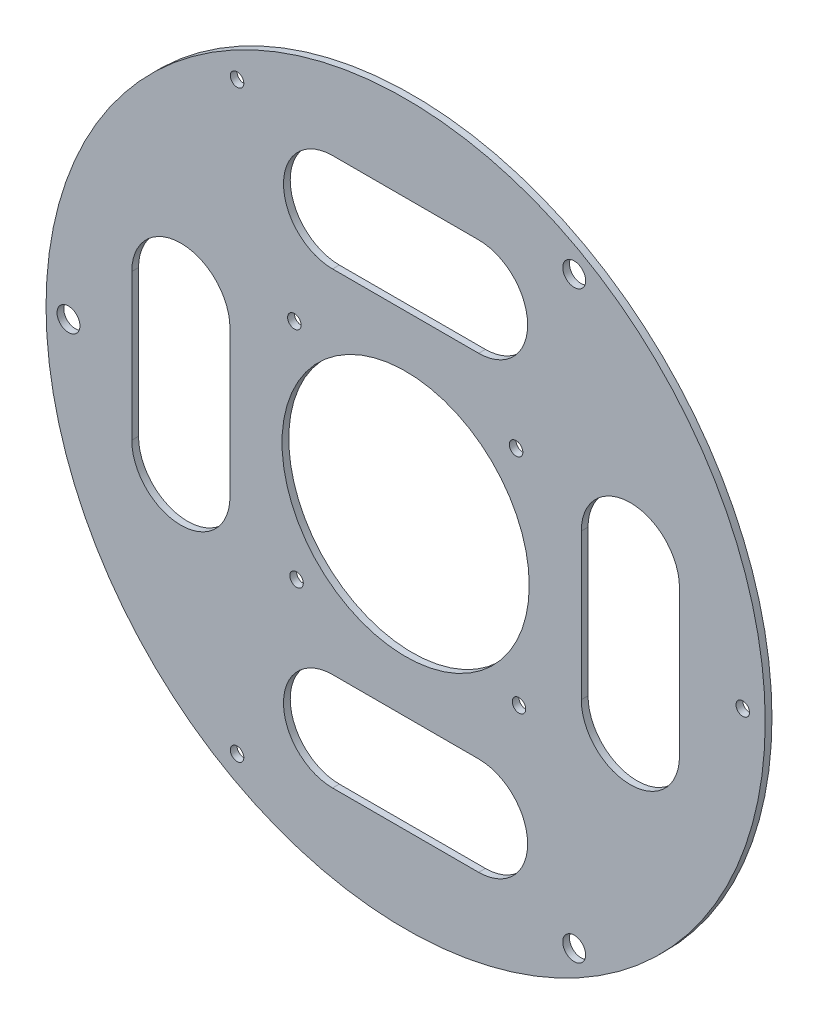
ISO-10303-21;
HEADER;
FILE_DESCRIPTION(('STEP AP214'),'2;1');
FILE_NAME('part.step','',(''),(''),'','','');
FILE_SCHEMA(('AUTOMOTIVE_DESIGN { 1 0 10303 214 1 1 1 1 }'));
ENDSEC;
DATA;
#1=APPLICATION_CONTEXT('core data for automotive mechanical design processes');
#2=APPLICATION_PROTOCOL_DEFINITION('international standard','automotive_design',2000,#1);
#3=PRODUCT_CONTEXT('',#1,'mechanical');
#4=PRODUCT('Part','Part','',(#3));
#5=PRODUCT_RELATED_PRODUCT_CATEGORY('part','',(#4));
#6=PRODUCT_DEFINITION_FORMATION('','',#4);
#7=PRODUCT_DEFINITION_CONTEXT('part definition',#1,'design');
#8=PRODUCT_DEFINITION('design','',#6,#7);
#9=PRODUCT_DEFINITION_SHAPE('','',#8);
#10=(LENGTH_UNIT() NAMED_UNIT(*) SI_UNIT(.MILLI.,.METRE.));
#11=(NAMED_UNIT(*) PLANE_ANGLE_UNIT() SI_UNIT($,.RADIAN.));
#12=(NAMED_UNIT(*) SI_UNIT($,.STERADIAN.) SOLID_ANGLE_UNIT());
#13=UNCERTAINTY_MEASURE_WITH_UNIT(LENGTH_MEASURE(1.E-05),#10,'distance_accuracy_value','');
#14=(GEOMETRIC_REPRESENTATION_CONTEXT(3) GLOBAL_UNCERTAINTY_ASSIGNED_CONTEXT((#13)) GLOBAL_UNIT_ASSIGNED_CONTEXT((#10,
#11,#12)) REPRESENTATION_CONTEXT('',''));
#15=CARTESIAN_POINT('',(0.,0.,0.));
#16=DIRECTION('',(0.,0.,1.));
#17=DIRECTION('',(1.,0.,0.));
#18=AXIS2_PLACEMENT_3D('',#15,#16,#17);
#19=CARTESIAN_POINT('',(0.,-78.1572470545592,3.));
#20=DIRECTION('',(0.,1.,0.));
#21=DIRECTION('',(-1.,0.,0.));
#22=AXIS2_PLACEMENT_3D('',#19,#20,#21);
#23=PLANE('',#22);
#24=DIRECTION('',(1.,0.,0.));
#25=VECTOR('',#24,1.);
#26=CARTESIAN_POINT('',(0.,-78.1572470545592,0.));
#27=LINE('',#26,#25);
#28=CARTESIAN_POINT('',(-32.5,-78.1572470545592,0.));
#29=VERTEX_POINT('',#28);
#30=CARTESIAN_POINT('',(32.5,-78.1572470545592,0.));
#31=VERTEX_POINT('',#30);
#32=EDGE_CURVE('E289',#29,#31,#27,.T.);
#33=ORIENTED_EDGE('',*,*,#32,.T.);
#34=DIRECTION('',(0.,0.,-1.));
#35=VECTOR('',#34,1.);
#36=CARTESIAN_POINT('',(32.5,-78.1572470545592,3.));
#37=LINE('',#36,#35);
#38=CARTESIAN_POINT('',(32.5,-78.1572470545592,3.));
#39=VERTEX_POINT('',#38);
#40=EDGE_CURVE('E11',#39,#31,#37,.T.);
#41=ORIENTED_EDGE('',*,*,#40,.F.);
#42=DIRECTION('',(1.,0.,0.));
#43=VECTOR('',#42,1.);
#44=CARTESIAN_POINT('',(0.,-78.1572470545592,3.));
#45=LINE('',#44,#43);
#46=CARTESIAN_POINT('',(-32.5,-78.1572470545592,3.));
#47=VERTEX_POINT('',#46);
#48=EDGE_CURVE('E172',#47,#39,#45,.T.);
#49=ORIENTED_EDGE('',*,*,#48,.F.);
#50=DIRECTION('',(0.,0.,-1.));
#51=VECTOR('',#50,1.);
#52=CARTESIAN_POINT('',(-32.5,-78.1572470545592,3.));
#53=LINE('',#52,#51);
#54=EDGE_CURVE('E64',#47,#29,#53,.T.);
#55=ORIENTED_EDGE('',*,*,#54,.T.);
#56=EDGE_LOOP('',(#33,#41,#49,#55));
#57=FACE_BOUND('',#56,.T.);
#58=ADVANCED_FACE('F44',(#57),#23,.F.);
#59=CARTESIAN_POINT('',(32.4365969784117,-100.,3.));
#60=DIRECTION('',(0.,0.,-1.));
#61=DIRECTION('',(-1.,0.,0.));
#62=AXIS2_PLACEMENT_3D('',#59,#60,#61);
#63=CYLINDRICAL_SURFACE('',#62,21.8428449653133);
#64=CARTESIAN_POINT('',(32.4365969784117,-100.,0.));
#65=DIRECTION('',(0.,0.,1.));
#66=DIRECTION('',(1.,0.,0.));
#67=AXIS2_PLACEMENT_3D('',#64,#65,#66);
#68=CIRCLE('',#67,21.8428449653133);
#69=CARTESIAN_POINT('',(32.5000000000185,-121.842752945441,0.));
#70=VERTEX_POINT('',#69);
#71=EDGE_CURVE('E179',#31,#70,#68,.F.);
#72=ORIENTED_EDGE('',*,*,#71,.T.);
#73=DIRECTION('',(0.,0.,-1.));
#74=VECTOR('',#73,1.);
#75=CARTESIAN_POINT('',(32.5000000000185,-121.842752945441,3.));
#76=LINE('',#75,#74);
#77=CARTESIAN_POINT('',(32.5000000000185,-121.842752945441,3.));
#78=VERTEX_POINT('',#77);
#79=EDGE_CURVE('E55',#78,#70,#76,.T.);
#80=ORIENTED_EDGE('',*,*,#79,.F.);
#81=CARTESIAN_POINT('',(32.4365969784117,-100.,3.));
#82=DIRECTION('',(0.,0.,1.));
#83=DIRECTION('',(1.,0.,0.));
#84=AXIS2_PLACEMENT_3D('',#81,#82,#83);
#85=CIRCLE('',#84,21.8428449653133);
#86=EDGE_CURVE('E166',#39,#78,#85,.F.);
#87=ORIENTED_EDGE('',*,*,#86,.F.);
#88=ORIENTED_EDGE('',*,*,#40,.T.);
#89=EDGE_LOOP('',(#72,#80,#87,#88));
#90=FACE_BOUND('',#89,.T.);
#91=ADVANCED_FACE('F178',(#90),#63,.F.);
#92=CARTESIAN_POINT('',(0.,-121.842752945441,3.));
#93=DIRECTION('',(0.,1.,0.));
#94=DIRECTION('',(-1.,0.,0.));
#95=AXIS2_PLACEMENT_3D('',#92,#93,#94);
#96=PLANE('',#95);
#97=DIRECTION('',(1.,0.,0.));
#98=VECTOR('',#97,1.);
#99=CARTESIAN_POINT('',(0.,-121.842752945441,0.));
#100=LINE('',#99,#98);
#101=CARTESIAN_POINT('',(-32.5,-121.842752945441,0.));
#102=VERTEX_POINT('',#101);
#103=EDGE_CURVE('E294',#102,#70,#100,.T.);
#104=ORIENTED_EDGE('',*,*,#103,.F.);
#105=DIRECTION('',(0.,0.,-1.));
#106=VECTOR('',#105,1.);
#107=CARTESIAN_POINT('',(-32.5,-121.842752945441,3.));
#108=LINE('',#107,#106);
#109=CARTESIAN_POINT('',(-32.5,-121.842752945441,3.));
#110=VERTEX_POINT('',#109);
#111=EDGE_CURVE('E114',#110,#102,#108,.T.);
#112=ORIENTED_EDGE('',*,*,#111,.F.);
#113=DIRECTION('',(1.,0.,0.));
#114=VECTOR('',#113,1.);
#115=CARTESIAN_POINT('',(0.,-121.842752945441,3.));
#116=LINE('',#115,#114);
#117=EDGE_CURVE('E171',#110,#78,#116,.T.);
#118=ORIENTED_EDGE('',*,*,#117,.T.);
#119=ORIENTED_EDGE('',*,*,#79,.T.);
#120=EDGE_LOOP('',(#104,#112,#118,#119));
#121=FACE_BOUND('',#120,.T.);
#122=ADVANCED_FACE('F184',(#121),#96,.T.);
#123=CARTESIAN_POINT('',(0.,78.1572470545592,3.));
#124=DIRECTION('',(0.,1.,0.));
#125=DIRECTION('',(-1.,0.,0.));
#126=AXIS2_PLACEMENT_3D('',#123,#124,#125);
#127=PLANE('',#126);
#128=DIRECTION('',(1.,0.,0.));
#129=VECTOR('',#128,1.);
#130=CARTESIAN_POINT('',(0.,78.1572470545592,0.));
#131=LINE('',#130,#129);
#132=CARTESIAN_POINT('',(-32.5,78.1572470545592,0.));
#133=VERTEX_POINT('',#132);
#134=CARTESIAN_POINT('',(32.5,78.1572470545592,0.));
#135=VERTEX_POINT('',#134);
#136=EDGE_CURVE('E273',#133,#135,#131,.T.);
#137=ORIENTED_EDGE('',*,*,#136,.F.);
#138=DIRECTION('',(0.,0.,-1.));
#139=VECTOR('',#138,1.);
#140=CARTESIAN_POINT('',(-32.5,78.1572470545592,3.));
#141=LINE('',#140,#139);
#142=CARTESIAN_POINT('',(-32.5,78.1572470545592,3.));
#143=VERTEX_POINT('',#142);
#144=EDGE_CURVE('E304',#143,#133,#141,.T.);
#145=ORIENTED_EDGE('',*,*,#144,.F.);
#146=DIRECTION('',(1.,0.,0.));
#147=VECTOR('',#146,1.);
#148=CARTESIAN_POINT('',(0.,78.1572470545592,3.));
#149=LINE('',#148,#147);
#150=CARTESIAN_POINT('',(32.5,78.1572470545592,3.));
#151=VERTEX_POINT('',#150);
#152=EDGE_CURVE('E391',#143,#151,#149,.T.);
#153=ORIENTED_EDGE('',*,*,#152,.T.);
#154=DIRECTION('',(0.,0.,-1.));
#155=VECTOR('',#154,1.);
#156=CARTESIAN_POINT('',(32.5,78.1572470545592,3.));
#157=LINE('',#156,#155);
#158=EDGE_CURVE('E307',#151,#135,#157,.T.);
#159=ORIENTED_EDGE('',*,*,#158,.T.);
#160=EDGE_LOOP('',(#137,#145,#153,#159));
#161=FACE_BOUND('',#160,.T.);
#162=ADVANCED_FACE('F422',(#161),#127,.T.);
#163=CARTESIAN_POINT('',(-32.5,100.,3.));
#164=DIRECTION('',(0.,0.,-1.));
#165=DIRECTION('',(-1.,0.,0.));
#166=AXIS2_PLACEMENT_3D('',#163,#164,#165);
#167=CYLINDRICAL_SURFACE('',#166,21.8427529454408);
#168=CARTESIAN_POINT('',(-32.5,100.,0.));
#169=DIRECTION('',(0.,0.,1.));
#170=DIRECTION('',(1.,0.,0.));
#171=AXIS2_PLACEMENT_3D('',#168,#169,#170);
#172=CIRCLE('',#171,21.8427529454408);
#173=CARTESIAN_POINT('',(-32.5,121.842752945441,0.));
#174=VERTEX_POINT('',#173);
#175=EDGE_CURVE('E277',#133,#174,#172,.F.);
#176=ORIENTED_EDGE('',*,*,#175,.T.);
#177=DIRECTION('',(0.,0.,-1.));
#178=VECTOR('',#177,1.);
#179=CARTESIAN_POINT('',(-32.5,121.842752945441,3.));
#180=LINE('',#179,#178);
#181=CARTESIAN_POINT('',(-32.5,121.842752945441,3.));
#182=VERTEX_POINT('',#181);
#183=EDGE_CURVE('E314',#182,#174,#180,.T.);
#184=ORIENTED_EDGE('',*,*,#183,.F.);
#185=CARTESIAN_POINT('',(-32.5,100.,3.));
#186=DIRECTION('',(0.,0.,1.));
#187=DIRECTION('',(1.,0.,0.));
#188=AXIS2_PLACEMENT_3D('',#185,#186,#187);
#189=CIRCLE('',#188,21.8427529454408);
#190=EDGE_CURVE('E395',#143,#182,#189,.F.);
#191=ORIENTED_EDGE('',*,*,#190,.F.);
#192=ORIENTED_EDGE('',*,*,#144,.T.);
#193=EDGE_LOOP('',(#176,#184,#191,#192));
#194=FACE_BOUND('',#193,.T.);
#195=ADVANCED_FACE('F424',(#194),#167,.F.);
#196=CARTESIAN_POINT('',(0.,121.842752945441,3.));
#197=DIRECTION('',(0.,1.,0.));
#198=DIRECTION('',(-1.,0.,0.));
#199=AXIS2_PLACEMENT_3D('',#196,#197,#198);
#200=PLANE('',#199);
#201=DIRECTION('',(1.,0.,0.));
#202=VECTOR('',#201,1.);
#203=CARTESIAN_POINT('',(0.,121.842752945441,0.));
#204=LINE('',#203,#202);
#205=CARTESIAN_POINT('',(32.5000000000185,121.842752945441,0.));
#206=VERTEX_POINT('',#205);
#207=EDGE_CURVE('E281',#174,#206,#204,.T.);
#208=ORIENTED_EDGE('',*,*,#207,.T.);
#209=DIRECTION('',(0.,0.,-1.));
#210=VECTOR('',#209,1.);
#211=CARTESIAN_POINT('',(32.5000000000185,121.842752945441,3.));
#212=LINE('',#211,#210);
#213=CARTESIAN_POINT('',(32.5000000000185,121.842752945441,3.));
#214=VERTEX_POINT('',#213);
#215=EDGE_CURVE('E310',#214,#206,#212,.T.);
#216=ORIENTED_EDGE('',*,*,#215,.F.);
#217=DIRECTION('',(1.,0.,0.));
#218=VECTOR('',#217,1.);
#219=CARTESIAN_POINT('',(0.,121.842752945441,3.));
#220=LINE('',#219,#218);
#221=EDGE_CURVE('E399',#182,#214,#220,.T.);
#222=ORIENTED_EDGE('',*,*,#221,.F.);
#223=ORIENTED_EDGE('',*,*,#183,.T.);
#224=EDGE_LOOP('',(#208,#216,#222,#223));
#225=FACE_BOUND('',#224,.T.);
#226=ADVANCED_FACE('F416',(#225),#200,.F.);
#227=CARTESIAN_POINT('',(100.,32.5,3.));
#228=DIRECTION('',(0.,0.,-1.));
#229=DIRECTION('',(-1.,0.,0.));
#230=AXIS2_PLACEMENT_3D('',#227,#228,#229);
#231=CYLINDRICAL_SURFACE('',#230,21.8427529454408);
#232=CARTESIAN_POINT('',(100.,32.5,0.));
#233=DIRECTION('',(0.,0.,1.));
#234=DIRECTION('',(1.,0.,0.));
#235=AXIS2_PLACEMENT_3D('',#232,#233,#234);
#236=CIRCLE('',#235,21.8427529454408);
#237=CARTESIAN_POINT('',(121.842752945441,32.5,0.));
#238=VERTEX_POINT('',#237);
#239=CARTESIAN_POINT('',(78.1572470545592,32.5,0.));
#240=VERTEX_POINT('',#239);
#241=EDGE_CURVE('E253',#238,#240,#236,.T.);
#242=ORIENTED_EDGE('',*,*,#241,.F.);
#243=DIRECTION('',(0.,0.,-1.));
#244=VECTOR('',#243,1.);
#245=CARTESIAN_POINT('',(121.842752945441,32.5,3.));
#246=LINE('',#245,#244);
#247=CARTESIAN_POINT('',(121.842752945441,32.5,3.));
#248=VERTEX_POINT('',#247);
#249=EDGE_CURVE('E311',#248,#238,#246,.T.);
#250=ORIENTED_EDGE('',*,*,#249,.F.);
#251=CARTESIAN_POINT('',(100.,32.5,3.));
#252=DIRECTION('',(0.,0.,1.));
#253=DIRECTION('',(1.,0.,0.));
#254=AXIS2_PLACEMENT_3D('',#251,#252,#253);
#255=CIRCLE('',#254,21.8427529454408);
#256=CARTESIAN_POINT('',(78.1572470545592,32.5,3.));
#257=VERTEX_POINT('',#256);
#258=EDGE_CURVE('E363',#248,#257,#255,.T.);
#259=ORIENTED_EDGE('',*,*,#258,.T.);
#260=DIRECTION('',(0.,0.,-1.));
#261=VECTOR('',#260,1.);
#262=CARTESIAN_POINT('',(78.1572470545592,32.5,3.));
#263=LINE('',#262,#261);
#264=EDGE_CURVE('E320',#257,#240,#263,.T.);
#265=ORIENTED_EDGE('',*,*,#264,.T.);
#266=EDGE_LOOP('',(#242,#250,#259,#265));
#267=FACE_BOUND('',#266,.T.);
#268=ADVANCED_FACE('F431',(#267),#231,.F.);
#269=CARTESIAN_POINT('',(121.842752945441,0.,3.));
#270=DIRECTION('',(1.,0.,0.));
#271=DIRECTION('',(0.,1.,0.));
#272=AXIS2_PLACEMENT_3D('',#269,#270,#271);
#273=PLANE('',#272);
#274=DIRECTION('',(0.,-1.,0.));
#275=VECTOR('',#274,1.);
#276=CARTESIAN_POINT('',(121.842752945441,0.,0.));
#277=LINE('',#276,#275);
#278=CARTESIAN_POINT('',(121.842752945441,-32.5,0.));
#279=VERTEX_POINT('',#278);
#280=EDGE_CURVE('E257',#238,#279,#277,.T.);
#281=ORIENTED_EDGE('',*,*,#280,.T.);
#282=DIRECTION('',(0.,0.,-1.));
#283=VECTOR('',#282,1.);
#284=CARTESIAN_POINT('',(121.842752945441,-32.5,3.));
#285=LINE('',#284,#283);
#286=CARTESIAN_POINT('',(121.842752945441,-32.5,3.));
#287=VERTEX_POINT('',#286);
#288=EDGE_CURVE('E326',#287,#279,#285,.T.);
#289=ORIENTED_EDGE('',*,*,#288,.F.);
#290=DIRECTION('',(0.,-1.,0.));
#291=VECTOR('',#290,1.);
#292=CARTESIAN_POINT('',(121.842752945441,0.,3.));
#293=LINE('',#292,#291);
#294=EDGE_CURVE('E376',#248,#287,#293,.T.);
#295=ORIENTED_EDGE('',*,*,#294,.F.);
#296=ORIENTED_EDGE('',*,*,#249,.T.);
#297=EDGE_LOOP('',(#281,#289,#295,#296));
#298=FACE_BOUND('',#297,.T.);
#299=ADVANCED_FACE('F579',(#298),#273,.F.);
#300=CARTESIAN_POINT('',(100.,-32.5,3.));
#301=DIRECTION('',(0.,0.,-1.));
#302=DIRECTION('',(-1.,0.,0.));
#303=AXIS2_PLACEMENT_3D('',#300,#301,#302);
#304=CYLINDRICAL_SURFACE('',#303,21.8427529454408);
#305=CARTESIAN_POINT('',(100.,-32.5,0.));
#306=DIRECTION('',(0.,0.,1.));
#307=DIRECTION('',(1.,0.,0.));
#308=AXIS2_PLACEMENT_3D('',#305,#306,#307);
#309=CIRCLE('',#308,21.8427529454408);
#310=CARTESIAN_POINT('',(78.1572470545592,-32.5,0.));
#311=VERTEX_POINT('',#310);
#312=EDGE_CURVE('E261',#279,#311,#309,.F.);
#313=ORIENTED_EDGE('',*,*,#312,.T.);
#314=DIRECTION('',(0.,0.,-1.));
#315=VECTOR('',#314,1.);
#316=CARTESIAN_POINT('',(78.1572470545592,-32.5,3.));
#317=LINE('',#316,#315);
#318=CARTESIAN_POINT('',(78.1572470545592,-32.5,3.));
#319=VERTEX_POINT('',#318);
#320=EDGE_CURVE('E323',#319,#311,#317,.T.);
#321=ORIENTED_EDGE('',*,*,#320,.F.);
#322=CARTESIAN_POINT('',(100.,-32.5,3.));
#323=DIRECTION('',(0.,0.,1.));
#324=DIRECTION('',(1.,0.,0.));
#325=AXIS2_PLACEMENT_3D('',#322,#323,#324);
#326=CIRCLE('',#325,21.8427529454408);
#327=EDGE_CURVE('E380',#287,#319,#326,.F.);
#328=ORIENTED_EDGE('',*,*,#327,.F.);
#329=ORIENTED_EDGE('',*,*,#288,.T.);
#330=EDGE_LOOP('',(#313,#321,#328,#329));
#331=FACE_BOUND('',#330,.T.);
#332=ADVANCED_FACE('F461',(#331),#304,.F.);
#333=CARTESIAN_POINT('',(-100.,-32.5,3.));
#334=DIRECTION('',(0.,0.,-1.));
#335=DIRECTION('',(-1.,0.,0.));
#336=AXIS2_PLACEMENT_3D('',#333,#334,#335);
#337=CYLINDRICAL_SURFACE('',#336,21.8427529454408);
#338=CARTESIAN_POINT('',(-100.,-32.5,0.));
#339=DIRECTION('',(0.,0.,1.));
#340=DIRECTION('',(1.,0.,0.));
#341=AXIS2_PLACEMENT_3D('',#338,#339,#340);
#342=CIRCLE('',#341,21.8427529454408);
#343=CARTESIAN_POINT('',(-121.842752945441,-32.5,0.));
#344=VERTEX_POINT('',#343);
#345=CARTESIAN_POINT('',(-78.1572470545592,-32.5,0.));
#346=VERTEX_POINT('',#345);
#347=EDGE_CURVE('E237',#344,#346,#342,.T.);
#348=ORIENTED_EDGE('',*,*,#347,.F.);
#349=DIRECTION('',(0.,0.,-1.));
#350=VECTOR('',#349,1.);
#351=CARTESIAN_POINT('',(-121.842752945441,-32.5,3.));
#352=LINE('',#351,#350);
#353=CARTESIAN_POINT('',(-121.842752945441,-32.5,3.));
#354=VERTEX_POINT('',#353);
#355=EDGE_CURVE('E48',#354,#344,#352,.T.);
#356=ORIENTED_EDGE('',*,*,#355,.F.);
#357=CARTESIAN_POINT('',(-100.,-32.5,3.));
#358=DIRECTION('',(0.,0.,1.));
#359=DIRECTION('',(1.,0.,0.));
#360=AXIS2_PLACEMENT_3D('',#357,#358,#359);
#361=CIRCLE('',#360,21.8427529454408);
#362=CARTESIAN_POINT('',(-78.1572470545592,-32.5,3.));
#363=VERTEX_POINT('',#362);
#364=EDGE_CURVE('E369',#354,#363,#361,.T.);
#365=ORIENTED_EDGE('',*,*,#364,.T.);
#366=DIRECTION('',(0.,0.,-1.));
#367=VECTOR('',#366,1.);
#368=CARTESIAN_POINT('',(-78.1572470545592,-32.5,3.));
#369=LINE('',#368,#367);
#370=EDGE_CURVE('E189',#363,#346,#369,.T.);
#371=ORIENTED_EDGE('',*,*,#370,.T.);
#372=EDGE_LOOP('',(#348,#356,#365,#371));
#373=FACE_BOUND('',#372,.T.);
#374=ADVANCED_FACE('F349',(#373),#337,.F.);
#375=CARTESIAN_POINT('',(-121.842752945441,0.,3.));
#376=DIRECTION('',(1.,0.,0.));
#377=DIRECTION('',(0.,1.,0.));
#378=AXIS2_PLACEMENT_3D('',#375,#376,#377);
#379=PLANE('',#378);
#380=DIRECTION('',(0.,-1.,0.));
#381=VECTOR('',#380,1.);
#382=CARTESIAN_POINT('',(-121.842752945441,0.,0.));
#383=LINE('',#382,#381);
#384=CARTESIAN_POINT('',(-121.842752945441,32.5,0.));
#385=VERTEX_POINT('',#384);
#386=EDGE_CURVE('E241',#385,#344,#383,.T.);
#387=ORIENTED_EDGE('',*,*,#386,.F.);
#388=DIRECTION('',(0.,0.,-1.));
#389=VECTOR('',#388,1.);
#390=CARTESIAN_POINT('',(-121.842752945441,32.5,3.));
#391=LINE('',#390,#389);
#392=CARTESIAN_POINT('',(-121.842752945441,32.5,3.));
#393=VERTEX_POINT('',#392);
#394=EDGE_CURVE('E337',#393,#385,#391,.T.);
#395=ORIENTED_EDGE('',*,*,#394,.F.);
#396=DIRECTION('',(0.,-1.,0.));
#397=VECTOR('',#396,1.);
#398=CARTESIAN_POINT('',(-121.842752945441,0.,3.));
#399=LINE('',#398,#397);
#400=EDGE_CURVE('E348',#393,#354,#399,.T.);
#401=ORIENTED_EDGE('',*,*,#400,.T.);
#402=ORIENTED_EDGE('',*,*,#355,.T.);
#403=EDGE_LOOP('',(#387,#395,#401,#402));
#404=FACE_BOUND('',#403,.T.);
#405=ADVANCED_FACE('F346',(#404),#379,.T.);
#406=CARTESIAN_POINT('',(-100.,32.5,3.));
#407=DIRECTION('',(0.,0.,-1.));
#408=DIRECTION('',(-1.,0.,0.));
#409=AXIS2_PLACEMENT_3D('',#406,#407,#408);
#410=CYLINDRICAL_SURFACE('',#409,21.8427529454408);
#411=CARTESIAN_POINT('',(-100.,32.5,0.));
#412=DIRECTION('',(0.,0.,1.));
#413=DIRECTION('',(1.,0.,0.));
#414=AXIS2_PLACEMENT_3D('',#411,#412,#413);
#415=CIRCLE('',#414,21.8427529454408);
#416=CARTESIAN_POINT('',(-78.1572470545592,32.5,0.));
#417=VERTEX_POINT('',#416);
#418=EDGE_CURVE('E245',#385,#417,#415,.F.);
#419=ORIENTED_EDGE('',*,*,#418,.T.);
#420=DIRECTION('',(0.,0.,-1.));
#421=VECTOR('',#420,1.);
#422=CARTESIAN_POINT('',(-78.1572470545592,32.5,3.));
#423=LINE('',#422,#421);
#424=CARTESIAN_POINT('',(-78.1572470545592,32.5,3.));
#425=VERTEX_POINT('',#424);
#426=EDGE_CURVE('E334',#425,#417,#423,.T.);
#427=ORIENTED_EDGE('',*,*,#426,.F.);
#428=CARTESIAN_POINT('',(-100.,32.5,3.));
#429=DIRECTION('',(0.,0.,1.));
#430=DIRECTION('',(1.,0.,0.));
#431=AXIS2_PLACEMENT_3D('',#428,#429,#430);
#432=CIRCLE('',#431,21.8427529454408);
#433=EDGE_CURVE('E357',#393,#425,#432,.F.);
#434=ORIENTED_EDGE('',*,*,#433,.F.);
#435=ORIENTED_EDGE('',*,*,#394,.T.);
#436=EDGE_LOOP('',(#419,#427,#434,#435));
#437=FACE_BOUND('',#436,.T.);
#438=ADVANCED_FACE('F355',(#437),#410,.F.);
#439=CARTESIAN_POINT('',(32.4365969784117,100.,3.));
#440=DIRECTION('',(0.,0.,-1.));
#441=DIRECTION('',(-1.,0.,0.));
#442=AXIS2_PLACEMENT_3D('',#439,#440,#441);
#443=CYLINDRICAL_SURFACE('',#442,21.8428449653133);
#444=CARTESIAN_POINT('',(32.4365969784117,100.,0.));
#445=DIRECTION('',(0.,0.,1.));
#446=DIRECTION('',(1.,0.,0.));
#447=AXIS2_PLACEMENT_3D('',#444,#445,#446);
#448=CIRCLE('',#447,21.8428449653133);
#449=EDGE_CURVE('E285',#135,#206,#448,.T.);
#450=ORIENTED_EDGE('',*,*,#449,.F.);
#451=ORIENTED_EDGE('',*,*,#158,.F.);
#452=CARTESIAN_POINT('',(32.4365969784117,100.,3.));
#453=DIRECTION('',(0.,0.,1.));
#454=DIRECTION('',(1.,0.,0.));
#455=AXIS2_PLACEMENT_3D('',#452,#453,#454);
#456=CIRCLE('',#455,21.8428449653133);
#457=EDGE_CURVE('E402',#151,#214,#456,.T.);
#458=ORIENTED_EDGE('',*,*,#457,.T.);
#459=ORIENTED_EDGE('',*,*,#215,.T.);
#460=EDGE_LOOP('',(#450,#451,#458,#459));
#461=FACE_BOUND('',#460,.T.);
#462=ADVANCED_FACE('F409',(#461),#443,.F.);
#463=CARTESIAN_POINT('',(0.,0.,3.));
#464=DIRECTION('',(0.,0.,-1.));
#465=DIRECTION('',(-1.,0.,0.));
#466=AXIS2_PLACEMENT_3D('',#463,#464,#465);
#467=CYLINDRICAL_SURFACE('',#466,160.);
#468=CARTESIAN_POINT('',(0.,0.,3.));
#469=DIRECTION('',(0.,0.,1.));
#470=DIRECTION('',(1.,0.,0.));
#471=AXIS2_PLACEMENT_3D('',#468,#469,#470);
#472=CIRCLE('',#471,160.);
#473=CARTESIAN_POINT('',(160.,0.,3.));
#474=VERTEX_POINT('',#473);
#475=EDGE_CURVE('E387',#474,#474,#472,.T.);
#476=ORIENTED_EDGE('',*,*,#475,.F.);
#477=EDGE_LOOP('',(#476));
#478=FACE_BOUND('',#477,.T.);
#479=CARTESIAN_POINT('',(0.,0.,0.));
#480=DIRECTION('',(0.,0.,1.));
#481=DIRECTION('',(1.,0.,0.));
#482=AXIS2_PLACEMENT_3D('',#479,#480,#481);
#483=CIRCLE('',#482,160.);
#484=CARTESIAN_POINT('',(160.,0.,0.));
#485=VERTEX_POINT('',#484);
#486=EDGE_CURVE('E269',#485,#485,#483,.T.);
#487=ORIENTED_EDGE('',*,*,#486,.T.);
#488=EDGE_LOOP('',(#487));
#489=FACE_BOUND('',#488,.T.);
#490=ADVANCED_FACE('F443',(#478,#489),#467,.T.);
#491=CARTESIAN_POINT('',(78.1572470545592,0.,3.));
#492=DIRECTION('',(1.,0.,0.));
#493=DIRECTION('',(0.,1.,0.));
#494=AXIS2_PLACEMENT_3D('',#491,#492,#493);
#495=PLANE('',#494);
#496=DIRECTION('',(0.,-1.,0.));
#497=VECTOR('',#496,1.);
#498=CARTESIAN_POINT('',(78.1572470545592,0.,0.));
#499=LINE('',#498,#497);
#500=EDGE_CURVE('E265',#240,#311,#499,.T.);
#501=ORIENTED_EDGE('',*,*,#500,.F.);
#502=ORIENTED_EDGE('',*,*,#264,.F.);
#503=DIRECTION('',(0.,-1.,0.));
#504=VECTOR('',#503,1.);
#505=CARTESIAN_POINT('',(78.1572470545592,0.,3.));
#506=LINE('',#505,#504);
#507=EDGE_CURVE('E383',#257,#319,#506,.T.);
#508=ORIENTED_EDGE('',*,*,#507,.T.);
#509=ORIENTED_EDGE('',*,*,#320,.T.);
#510=EDGE_LOOP('',(#501,#502,#508,#509));
#511=FACE_BOUND('',#510,.T.);
#512=ADVANCED_FACE('F448',(#511),#495,.T.);
#513=CARTESIAN_POINT('',(-78.1572470545592,0.,3.));
#514=DIRECTION('',(1.,0.,0.));
#515=DIRECTION('',(0.,1.,0.));
#516=AXIS2_PLACEMENT_3D('',#513,#514,#515);
#517=PLANE('',#516);
#518=DIRECTION('',(0.,-1.,0.));
#519=VECTOR('',#518,1.);
#520=CARTESIAN_POINT('',(-78.1572470545592,0.,0.));
#521=LINE('',#520,#519);
#522=EDGE_CURVE('E249',#417,#346,#521,.T.);
#523=ORIENTED_EDGE('',*,*,#522,.T.);
#524=ORIENTED_EDGE('',*,*,#370,.F.);
#525=DIRECTION('',(0.,-1.,0.));
#526=VECTOR('',#525,1.);
#527=CARTESIAN_POINT('',(-78.1572470545592,0.,3.));
#528=LINE('',#527,#526);
#529=EDGE_CURVE('E360',#425,#363,#528,.T.);
#530=ORIENTED_EDGE('',*,*,#529,.F.);
#531=ORIENTED_EDGE('',*,*,#426,.T.);
#532=EDGE_LOOP('',(#523,#524,#530,#531));
#533=FACE_BOUND('',#532,.T.);
#534=ADVANCED_FACE('F359',(#533),#517,.F.);
#535=CARTESIAN_POINT('',(-150.,0.,3.));
#536=DIRECTION('',(0.,0.,-1.));
#537=DIRECTION('',(-1.,0.,0.));
#538=AXIS2_PLACEMENT_3D('',#535,#536,#537);
#539=CYLINDRICAL_SURFACE('',#538,5.09999999999998);
#540=CARTESIAN_POINT('',(-150.,0.,3.));
#541=DIRECTION('',(0.,0.,1.));
#542=DIRECTION('',(1.,0.,0.));
#543=AXIS2_PLACEMENT_3D('',#540,#541,#542);
#544=CIRCLE('',#543,5.09999999999998);
#545=CARTESIAN_POINT('',(-144.9,0.,3.));
#546=VERTEX_POINT('',#545);
#547=EDGE_CURVE('E845',#546,#546,#544,.T.);
#548=ORIENTED_EDGE('',*,*,#547,.T.);
#549=EDGE_LOOP('',(#548));
#550=FACE_BOUND('',#549,.T.);
#551=CARTESIAN_POINT('',(-150.,0.,0.));
#552=DIRECTION('',(0.,0.,1.));
#553=DIRECTION('',(1.,0.,0.));
#554=AXIS2_PLACEMENT_3D('',#551,#552,#553);
#555=CIRCLE('',#554,5.09999999999998);
#556=CARTESIAN_POINT('',(-144.9,0.,0.));
#557=VERTEX_POINT('',#556);
#558=EDGE_CURVE('E233',#557,#557,#555,.T.);
#559=ORIENTED_EDGE('',*,*,#558,.F.);
#560=EDGE_LOOP('',(#559));
#561=FACE_BOUND('',#560,.T.);
#562=ADVANCED_FACE('F462',(#550,#561),#539,.F.);
#563=CARTESIAN_POINT('',(-48.5327301826037,-49.522943910925,3.));
#564=DIRECTION('',(0.,0.,-1.));
#565=DIRECTION('',(-1.,0.,0.));
#566=AXIS2_PLACEMENT_3D('',#563,#564,#565);
#567=CYLINDRICAL_SURFACE('',#566,3.);
#568=CARTESIAN_POINT('',(-48.5327301826037,-49.522943910925,3.));
#569=DIRECTION('',(0.,0.,1.));
#570=DIRECTION('',(1.,0.,0.));
#571=AXIS2_PLACEMENT_3D('',#568,#569,#570);
#572=CIRCLE('',#571,3.);
#573=CARTESIAN_POINT('',(-45.5327301826037,-49.522943910925,3.));
#574=VERTEX_POINT('',#573);
#575=EDGE_CURVE('E842',#574,#574,#572,.T.);
#576=ORIENTED_EDGE('',*,*,#575,.T.);
#577=EDGE_LOOP('',(#576));
#578=FACE_BOUND('',#577,.T.);
#579=CARTESIAN_POINT('',(-48.5327301826037,-49.522943910925,0.));
#580=DIRECTION('',(0.,0.,1.));
#581=DIRECTION('',(1.,0.,0.));
#582=AXIS2_PLACEMENT_3D('',#579,#580,#581);
#583=CIRCLE('',#582,3.);
#584=CARTESIAN_POINT('',(-45.5327301826037,-49.522943910925,0.));
#585=VERTEX_POINT('',#584);
#586=EDGE_CURVE('E229',#585,#585,#583,.T.);
#587=ORIENTED_EDGE('',*,*,#586,.F.);
#588=EDGE_LOOP('',(#587));
#589=FACE_BOUND('',#588,.T.);
#590=ADVANCED_FACE('F465',(#578,#589),#567,.F.);
#591=CARTESIAN_POINT('',(74.9999999999988,129.903810567666,3.));
#592=DIRECTION('',(0.,0.,-1.));
#593=DIRECTION('',(-1.,0.,0.));
#594=AXIS2_PLACEMENT_3D('',#591,#592,#593);
#595=CYLINDRICAL_SURFACE('',#594,5.1);
#596=CARTESIAN_POINT('',(74.9999999999988,129.903810567666,3.));
#597=DIRECTION('',(0.,0.,1.));
#598=DIRECTION('',(1.,0.,0.));
#599=AXIS2_PLACEMENT_3D('',#596,#597,#598);
#600=CIRCLE('',#599,5.1);
#601=CARTESIAN_POINT('',(80.0999999999988,129.903810567666,3.));
#602=VERTEX_POINT('',#601);
#603=EDGE_CURVE('E838',#602,#602,#600,.T.);
#604=ORIENTED_EDGE('',*,*,#603,.T.);
#605=EDGE_LOOP('',(#604));
#606=FACE_BOUND('',#605,.T.);
#607=CARTESIAN_POINT('',(74.9999999999988,129.903810567666,0.));
#608=DIRECTION('',(0.,0.,1.));
#609=DIRECTION('',(1.,0.,0.));
#610=AXIS2_PLACEMENT_3D('',#607,#608,#609);
#611=CIRCLE('',#610,5.1);
#612=CARTESIAN_POINT('',(80.0999999999988,129.903810567666,0.));
#613=VERTEX_POINT('',#612);
#614=EDGE_CURVE('E225',#613,#613,#611,.T.);
#615=ORIENTED_EDGE('',*,*,#614,.F.);
#616=EDGE_LOOP('',(#615));
#617=FACE_BOUND('',#616,.T.);
#618=ADVANCED_FACE('F469',(#606,#617),#595,.F.);
#619=CARTESIAN_POINT('',(75.0000000000006,-129.903810567665,3.));
#620=DIRECTION('',(0.,0.,-1.));
#621=DIRECTION('',(-1.,0.,0.));
#622=AXIS2_PLACEMENT_3D('',#619,#620,#621);
#623=CYLINDRICAL_SURFACE('',#622,5.1);
#624=CARTESIAN_POINT('',(75.0000000000006,-129.903810567665,3.));
#625=DIRECTION('',(0.,0.,1.));
#626=DIRECTION('',(1.,0.,0.));
#627=AXIS2_PLACEMENT_3D('',#624,#625,#626);
#628=CIRCLE('',#627,5.1);
#629=CARTESIAN_POINT('',(80.1000000000006,-129.903810567665,3.));
#630=VERTEX_POINT('',#629);
#631=EDGE_CURVE('E834',#630,#630,#628,.T.);
#632=ORIENTED_EDGE('',*,*,#631,.T.);
#633=EDGE_LOOP('',(#632));
#634=FACE_BOUND('',#633,.T.);
#635=CARTESIAN_POINT('',(75.0000000000006,-129.903810567665,0.));
#636=DIRECTION('',(0.,0.,1.));
#637=DIRECTION('',(1.,0.,0.));
#638=AXIS2_PLACEMENT_3D('',#635,#636,#637);
#639=CIRCLE('',#638,5.1);
#640=CARTESIAN_POINT('',(80.1000000000006,-129.903810567665,0.));
#641=VERTEX_POINT('',#640);
#642=EDGE_CURVE('E221',#641,#641,#639,.T.);
#643=ORIENTED_EDGE('',*,*,#642,.F.);
#644=EDGE_LOOP('',(#643));
#645=FACE_BOUND('',#644,.T.);
#646=ADVANCED_FACE('F473',(#634,#645),#623,.F.);
#647=CARTESIAN_POINT('',(-75.0000000000015,129.903810567665,3.));
#648=DIRECTION('',(0.,0.,-1.));
#649=DIRECTION('',(-1.,0.,0.));
#650=AXIS2_PLACEMENT_3D('',#647,#648,#649);
#651=CYLINDRICAL_SURFACE('',#650,3.00000000000001);
#652=CARTESIAN_POINT('',(-75.0000000000015,129.903810567665,3.));
#653=DIRECTION('',(0.,0.,1.));
#654=DIRECTION('',(1.,0.,0.));
#655=AXIS2_PLACEMENT_3D('',#652,#653,#654);
#656=CIRCLE('',#655,3.00000000000001);
#657=CARTESIAN_POINT('',(-72.0000000000015,129.903810567665,3.));
#658=VERTEX_POINT('',#657);
#659=EDGE_CURVE('E830',#658,#658,#656,.T.);
#660=ORIENTED_EDGE('',*,*,#659,.T.);
#661=EDGE_LOOP('',(#660));
#662=FACE_BOUND('',#661,.T.);
#663=CARTESIAN_POINT('',(-75.0000000000015,129.903810567665,0.));
#664=DIRECTION('',(0.,0.,1.));
#665=DIRECTION('',(1.,0.,0.));
#666=AXIS2_PLACEMENT_3D('',#663,#664,#665);
#667=CIRCLE('',#666,3.00000000000001);
#668=CARTESIAN_POINT('',(-72.0000000000015,129.903810567665,0.));
#669=VERTEX_POINT('',#668);
#670=EDGE_CURVE('E217',#669,#669,#667,.T.);
#671=ORIENTED_EDGE('',*,*,#670,.F.);
#672=EDGE_LOOP('',(#671));
#673=FACE_BOUND('',#672,.T.);
#674=ADVANCED_FACE('F477',(#662,#673),#651,.F.);
#675=CARTESIAN_POINT('',(150.,1.06581410364015E-12,3.));
#676=DIRECTION('',(0.,0.,-1.));
#677=DIRECTION('',(-1.,0.,0.));
#678=AXIS2_PLACEMENT_3D('',#675,#676,#677);
#679=CYLINDRICAL_SURFACE('',#678,2.99999999999999);
#680=CARTESIAN_POINT('',(150.,1.06581410364015E-12,3.));
#681=DIRECTION('',(0.,0.,1.));
#682=DIRECTION('',(1.,0.,0.));
#683=AXIS2_PLACEMENT_3D('',#680,#681,#682);
#684=CIRCLE('',#683,2.99999999999999);
#685=CARTESIAN_POINT('',(153.,1.06581410364015E-12,3.));
#686=VERTEX_POINT('',#685);
#687=EDGE_CURVE('E826',#686,#686,#684,.T.);
#688=ORIENTED_EDGE('',*,*,#687,.T.);
#689=EDGE_LOOP('',(#688));
#690=FACE_BOUND('',#689,.T.);
#691=CARTESIAN_POINT('',(150.,1.06581410364015E-12,0.));
#692=DIRECTION('',(0.,0.,1.));
#693=DIRECTION('',(1.,0.,0.));
#694=AXIS2_PLACEMENT_3D('',#691,#692,#693);
#695=CIRCLE('',#694,2.99999999999999);
#696=CARTESIAN_POINT('',(153.,1.06581410364015E-12,0.));
#697=VERTEX_POINT('',#696);
#698=EDGE_CURVE('E213',#697,#697,#695,.T.);
#699=ORIENTED_EDGE('',*,*,#698,.F.);
#700=EDGE_LOOP('',(#699));
#701=FACE_BOUND('',#700,.T.);
#702=ADVANCED_FACE('F481',(#690,#701),#679,.F.);
#703=CARTESIAN_POINT('',(-74.9999999999997,-129.903810567666,3.));
#704=DIRECTION('',(0.,0.,-1.));
#705=DIRECTION('',(-1.,0.,0.));
#706=AXIS2_PLACEMENT_3D('',#703,#704,#705);
#707=CYLINDRICAL_SURFACE('',#706,3.00000000000001);
#708=CARTESIAN_POINT('',(-74.9999999999997,-129.903810567666,3.));
#709=DIRECTION('',(0.,0.,1.));
#710=DIRECTION('',(1.,0.,0.));
#711=AXIS2_PLACEMENT_3D('',#708,#709,#710);
#712=CIRCLE('',#711,3.00000000000001);
#713=CARTESIAN_POINT('',(-71.9999999999997,-129.903810567666,3.));
#714=VERTEX_POINT('',#713);
#715=EDGE_CURVE('E822',#714,#714,#712,.T.);
#716=ORIENTED_EDGE('',*,*,#715,.T.);
#717=EDGE_LOOP('',(#716));
#718=FACE_BOUND('',#717,.T.);
#719=CARTESIAN_POINT('',(-74.9999999999997,-129.903810567666,0.));
#720=DIRECTION('',(0.,0.,1.));
#721=DIRECTION('',(1.,0.,0.));
#722=AXIS2_PLACEMENT_3D('',#719,#720,#721);
#723=CIRCLE('',#722,3.00000000000001);
#724=CARTESIAN_POINT('',(-71.9999999999997,-129.903810567666,0.));
#725=VERTEX_POINT('',#724);
#726=EDGE_CURVE('E209',#725,#725,#723,.T.);
#727=ORIENTED_EDGE('',*,*,#726,.F.);
#728=EDGE_LOOP('',(#727));
#729=FACE_BOUND('',#728,.T.);
#730=ADVANCED_FACE('F485',(#718,#729),#707,.F.);
#731=CARTESIAN_POINT('',(-49.4997689979038,49.4951802618614,3.));
#732=DIRECTION('',(0.,0.,-1.));
#733=DIRECTION('',(-1.,0.,0.));
#734=AXIS2_PLACEMENT_3D('',#731,#732,#733);
#735=CYLINDRICAL_SURFACE('',#734,2.99999999999999);
#736=CARTESIAN_POINT('',(-49.4997689979038,49.4951802618614,3.));
#737=DIRECTION('',(0.,0.,1.));
#738=DIRECTION('',(1.,0.,0.));
#739=AXIS2_PLACEMENT_3D('',#736,#737,#738);
#740=CIRCLE('',#739,2.99999999999999);
#741=CARTESIAN_POINT('',(-46.4997689979038,49.4951802618614,3.));
#742=VERTEX_POINT('',#741);
#743=EDGE_CURVE('E818',#742,#742,#740,.T.);
#744=ORIENTED_EDGE('',*,*,#743,.T.);
#745=EDGE_LOOP('',(#744));
#746=FACE_BOUND('',#745,.T.);
#747=CARTESIAN_POINT('',(-49.4997689979038,49.4951802618614,0.));
#748=DIRECTION('',(0.,0.,1.));
#749=DIRECTION('',(1.,0.,0.));
#750=AXIS2_PLACEMENT_3D('',#747,#748,#749);
#751=CIRCLE('',#750,2.99999999999999);
#752=CARTESIAN_POINT('',(-46.4997689979038,49.4951802618614,0.));
#753=VERTEX_POINT('',#752);
#754=EDGE_CURVE('E205',#753,#753,#751,.T.);
#755=ORIENTED_EDGE('',*,*,#754,.F.);
#756=EDGE_LOOP('',(#755));
#757=FACE_BOUND('',#756,.T.);
#758=ADVANCED_FACE('F489',(#746,#757),#735,.F.);
#759=CARTESIAN_POINT('',(50.435655769884,-48.541164253258,3.));
#760=DIRECTION('',(0.,0.,-1.));
#761=DIRECTION('',(-1.,0.,0.));
#762=AXIS2_PLACEMENT_3D('',#759,#760,#761);
#763=CYLINDRICAL_SURFACE('',#762,3.);
#764=CARTESIAN_POINT('',(50.435655769884,-48.541164253258,3.));
#765=DIRECTION('',(0.,0.,1.));
#766=DIRECTION('',(1.,0.,0.));
#767=AXIS2_PLACEMENT_3D('',#764,#765,#766);
#768=CIRCLE('',#767,3.);
#769=CARTESIAN_POINT('',(53.435655769884,-48.541164253258,3.));
#770=VERTEX_POINT('',#769);
#771=EDGE_CURVE('E814',#770,#770,#768,.T.);
#772=ORIENTED_EDGE('',*,*,#771,.T.);
#773=EDGE_LOOP('',(#772));
#774=FACE_BOUND('',#773,.T.);
#775=CARTESIAN_POINT('',(50.435655769884,-48.541164253258,0.));
#776=DIRECTION('',(0.,0.,1.));
#777=DIRECTION('',(1.,0.,0.));
#778=AXIS2_PLACEMENT_3D('',#775,#776,#777);
#779=CIRCLE('',#778,3.);
#780=CARTESIAN_POINT('',(53.435655769884,-48.541164253258,0.));
#781=VERTEX_POINT('',#780);
#782=EDGE_CURVE('E201',#781,#781,#779,.T.);
#783=ORIENTED_EDGE('',*,*,#782,.F.);
#784=EDGE_LOOP('',(#783));
#785=FACE_BOUND('',#784,.T.);
#786=ADVANCED_FACE('F493',(#774,#785),#763,.F.);
#787=CARTESIAN_POINT('',(49.1443837079334,49.8480646561871,3.));
#788=DIRECTION('',(0.,0.,-1.));
#789=DIRECTION('',(-1.,0.,0.));
#790=AXIS2_PLACEMENT_3D('',#787,#788,#789);
#791=CYLINDRICAL_SURFACE('',#790,3.);
#792=CARTESIAN_POINT('',(49.1443837079334,49.8480646561871,3.));
#793=DIRECTION('',(0.,0.,1.));
#794=DIRECTION('',(1.,0.,0.));
#795=AXIS2_PLACEMENT_3D('',#792,#793,#794);
#796=CIRCLE('',#795,3.);
#797=CARTESIAN_POINT('',(52.1443837079334,49.8480646561871,3.));
#798=VERTEX_POINT('',#797);
#799=EDGE_CURVE('E508',#798,#798,#796,.T.);
#800=ORIENTED_EDGE('',*,*,#799,.T.);
#801=EDGE_LOOP('',(#800));
#802=FACE_BOUND('',#801,.T.);
#803=CARTESIAN_POINT('',(49.1443837079334,49.8480646561871,0.));
#804=DIRECTION('',(0.,0.,1.));
#805=DIRECTION('',(1.,0.,0.));
#806=AXIS2_PLACEMENT_3D('',#803,#804,#805);
#807=CIRCLE('',#806,3.);
#808=CARTESIAN_POINT('',(52.1443837079334,49.8480646561871,0.));
#809=VERTEX_POINT('',#808);
#810=EDGE_CURVE('E197',#809,#809,#807,.T.);
#811=ORIENTED_EDGE('',*,*,#810,.F.);
#812=EDGE_LOOP('',(#811));
#813=FACE_BOUND('',#812,.T.);
#814=ADVANCED_FACE('F496',(#802,#813),#791,.F.);
#815=CARTESIAN_POINT('',(0.,0.,3.));
#816=DIRECTION('',(0.,0.,-1.));
#817=DIRECTION('',(-1.,0.,0.));
#818=AXIS2_PLACEMENT_3D('',#815,#816,#817);
#819=CYLINDRICAL_SURFACE('',#818,55.);
#820=CARTESIAN_POINT('',(0.,0.,3.));
#821=DIRECTION('',(0.,0.,1.));
#822=DIRECTION('',(1.,0.,0.));
#823=AXIS2_PLACEMENT_3D('',#820,#821,#822);
#824=CIRCLE('',#823,55.);
#825=CARTESIAN_POINT('',(55.,0.,3.));
#826=VERTEX_POINT('',#825);
#827=EDGE_CURVE('E301',#826,#826,#824,.T.);
#828=ORIENTED_EDGE('',*,*,#827,.T.);
#829=EDGE_LOOP('',(#828));
#830=FACE_BOUND('',#829,.T.);
#831=CARTESIAN_POINT('',(0.,0.,0.));
#832=DIRECTION('',(0.,0.,1.));
#833=DIRECTION('',(1.,0.,0.));
#834=AXIS2_PLACEMENT_3D('',#831,#832,#833);
#835=CIRCLE('',#834,55.);
#836=CARTESIAN_POINT('',(55.,0.,0.));
#837=VERTEX_POINT('',#836);
#838=EDGE_CURVE('E193',#837,#837,#835,.T.);
#839=ORIENTED_EDGE('',*,*,#838,.F.);
#840=EDGE_LOOP('',(#839));
#841=FACE_BOUND('',#840,.T.);
#842=ADVANCED_FACE('F46',(#830,#841),#819,.F.);
#843=CARTESIAN_POINT('',(-32.5,-100.,3.));
#844=DIRECTION('',(0.,0.,-1.));
#845=DIRECTION('',(-1.,0.,0.));
#846=AXIS2_PLACEMENT_3D('',#843,#844,#845);
#847=CYLINDRICAL_SURFACE('',#846,21.8427529454408);
#848=CARTESIAN_POINT('',(-32.5,-100.,0.));
#849=DIRECTION('',(0.,0.,1.));
#850=DIRECTION('',(1.,0.,0.));
#851=AXIS2_PLACEMENT_3D('',#848,#849,#850);
#852=CIRCLE('',#851,21.8427529454408);
#853=EDGE_CURVE('E297',#29,#102,#852,.T.);
#854=ORIENTED_EDGE('',*,*,#853,.F.);
#855=ORIENTED_EDGE('',*,*,#54,.F.);
#856=CARTESIAN_POINT('',(-32.5,-100.,3.));
#857=DIRECTION('',(0.,0.,1.));
#858=DIRECTION('',(1.,0.,0.));
#859=AXIS2_PLACEMENT_3D('',#856,#857,#858);
#860=CIRCLE('',#859,21.8427529454408);
#861=EDGE_CURVE('E186',#47,#110,#860,.T.);
#862=ORIENTED_EDGE('',*,*,#861,.T.);
#863=ORIENTED_EDGE('',*,*,#111,.T.);
#864=EDGE_LOOP('',(#854,#855,#862,#863));
#865=FACE_BOUND('',#864,.T.);
#866=ADVANCED_FACE('F503',(#865),#847,.F.);
#867=CARTESIAN_POINT('',(0.,0.,3.));
#868=DIRECTION('',(0.,0.,1.));
#869=DIRECTION('',(1.,0.,0.));
#870=AXIS2_PLACEMENT_3D('',#867,#868,#869);
#871=PLANE('',#870);
#872=ORIENTED_EDGE('',*,*,#827,.F.);
#873=EDGE_LOOP('',(#872));
#874=FACE_BOUND('',#873,.T.);
#875=ORIENTED_EDGE('',*,*,#799,.F.);
#876=EDGE_LOOP('',(#875));
#877=FACE_BOUND('',#876,.T.);
#878=ORIENTED_EDGE('',*,*,#771,.F.);
#879=EDGE_LOOP('',(#878));
#880=FACE_BOUND('',#879,.T.);
#881=ORIENTED_EDGE('',*,*,#743,.F.);
#882=EDGE_LOOP('',(#881));
#883=FACE_BOUND('',#882,.T.);
#884=ORIENTED_EDGE('',*,*,#715,.F.);
#885=EDGE_LOOP('',(#884));
#886=FACE_BOUND('',#885,.T.);
#887=ORIENTED_EDGE('',*,*,#687,.F.);
#888=EDGE_LOOP('',(#887));
#889=FACE_BOUND('',#888,.T.);
#890=ORIENTED_EDGE('',*,*,#659,.F.);
#891=EDGE_LOOP('',(#890));
#892=FACE_BOUND('',#891,.T.);
#893=ORIENTED_EDGE('',*,*,#631,.F.);
#894=EDGE_LOOP('',(#893));
#895=FACE_BOUND('',#894,.T.);
#896=ORIENTED_EDGE('',*,*,#603,.F.);
#897=EDGE_LOOP('',(#896));
#898=FACE_BOUND('',#897,.T.);
#899=ORIENTED_EDGE('',*,*,#575,.F.);
#900=EDGE_LOOP('',(#899));
#901=FACE_BOUND('',#900,.T.);
#902=ORIENTED_EDGE('',*,*,#547,.F.);
#903=EDGE_LOOP('',(#902));
#904=FACE_BOUND('',#903,.T.);
#905=ORIENTED_EDGE('',*,*,#364,.F.);
#906=ORIENTED_EDGE('',*,*,#400,.F.);
#907=ORIENTED_EDGE('',*,*,#433,.T.);
#908=ORIENTED_EDGE('',*,*,#529,.T.);
#909=EDGE_LOOP('',(#905,#906,#907,#908));
#910=FACE_BOUND('',#909,.T.);
#911=ORIENTED_EDGE('',*,*,#258,.F.);
#912=ORIENTED_EDGE('',*,*,#294,.T.);
#913=ORIENTED_EDGE('',*,*,#327,.T.);
#914=ORIENTED_EDGE('',*,*,#507,.F.);
#915=EDGE_LOOP('',(#911,#912,#913,#914));
#916=FACE_BOUND('',#915,.T.);
#917=ORIENTED_EDGE('',*,*,#475,.T.);
#918=EDGE_LOOP('',(#917));
#919=FACE_BOUND('',#918,.T.);
#920=ORIENTED_EDGE('',*,*,#152,.F.);
#921=ORIENTED_EDGE('',*,*,#190,.T.);
#922=ORIENTED_EDGE('',*,*,#221,.T.);
#923=ORIENTED_EDGE('',*,*,#457,.F.);
#924=EDGE_LOOP('',(#920,#921,#922,#923));
#925=FACE_BOUND('',#924,.T.);
#926=ORIENTED_EDGE('',*,*,#48,.T.);
#927=ORIENTED_EDGE('',*,*,#86,.T.);
#928=ORIENTED_EDGE('',*,*,#117,.F.);
#929=ORIENTED_EDGE('',*,*,#861,.F.);
#930=EDGE_LOOP('',(#926,#927,#928,#929));
#931=FACE_BOUND('',#930,.T.);
#932=ADVANCED_FACE('F168',(#874,#877,#880,#883,#886,#889,#892,#895,#898,#901,#904,#910,#916,
#919,#925,#931),#871,.T.);
#933=CARTESIAN_POINT('',(0.,0.,0.));
#934=DIRECTION('',(0.,0.,1.));
#935=DIRECTION('',(1.,0.,0.));
#936=AXIS2_PLACEMENT_3D('',#933,#934,#935);
#937=PLANE('',#936);
#938=ORIENTED_EDGE('',*,*,#838,.T.);
#939=EDGE_LOOP('',(#938));
#940=FACE_BOUND('',#939,.T.);
#941=ORIENTED_EDGE('',*,*,#810,.T.);
#942=EDGE_LOOP('',(#941));
#943=FACE_BOUND('',#942,.T.);
#944=ORIENTED_EDGE('',*,*,#782,.T.);
#945=EDGE_LOOP('',(#944));
#946=FACE_BOUND('',#945,.T.);
#947=ORIENTED_EDGE('',*,*,#754,.T.);
#948=EDGE_LOOP('',(#947));
#949=FACE_BOUND('',#948,.T.);
#950=ORIENTED_EDGE('',*,*,#726,.T.);
#951=EDGE_LOOP('',(#950));
#952=FACE_BOUND('',#951,.T.);
#953=ORIENTED_EDGE('',*,*,#698,.T.);
#954=EDGE_LOOP('',(#953));
#955=FACE_BOUND('',#954,.T.);
#956=ORIENTED_EDGE('',*,*,#670,.T.);
#957=EDGE_LOOP('',(#956));
#958=FACE_BOUND('',#957,.T.);
#959=ORIENTED_EDGE('',*,*,#642,.T.);
#960=EDGE_LOOP('',(#959));
#961=FACE_BOUND('',#960,.T.);
#962=ORIENTED_EDGE('',*,*,#614,.T.);
#963=EDGE_LOOP('',(#962));
#964=FACE_BOUND('',#963,.T.);
#965=ORIENTED_EDGE('',*,*,#586,.T.);
#966=EDGE_LOOP('',(#965));
#967=FACE_BOUND('',#966,.T.);
#968=ORIENTED_EDGE('',*,*,#558,.T.);
#969=EDGE_LOOP('',(#968));
#970=FACE_BOUND('',#969,.T.);
#971=ORIENTED_EDGE('',*,*,#347,.T.);
#972=ORIENTED_EDGE('',*,*,#522,.F.);
#973=ORIENTED_EDGE('',*,*,#418,.F.);
#974=ORIENTED_EDGE('',*,*,#386,.T.);
#975=EDGE_LOOP('',(#971,#972,#973,#974));
#976=FACE_BOUND('',#975,.T.);
#977=ORIENTED_EDGE('',*,*,#241,.T.);
#978=ORIENTED_EDGE('',*,*,#500,.T.);
#979=ORIENTED_EDGE('',*,*,#312,.F.);
#980=ORIENTED_EDGE('',*,*,#280,.F.);
#981=EDGE_LOOP('',(#977,#978,#979,#980));
#982=FACE_BOUND('',#981,.T.);
#983=ORIENTED_EDGE('',*,*,#486,.F.);
#984=EDGE_LOOP('',(#983));
#985=FACE_BOUND('',#984,.T.);
#986=ORIENTED_EDGE('',*,*,#136,.T.);
#987=ORIENTED_EDGE('',*,*,#449,.T.);
#988=ORIENTED_EDGE('',*,*,#207,.F.);
#989=ORIENTED_EDGE('',*,*,#175,.F.);
#990=EDGE_LOOP('',(#986,#987,#988,#989));
#991=FACE_BOUND('',#990,.T.);
#992=ORIENTED_EDGE('',*,*,#32,.F.);
#993=ORIENTED_EDGE('',*,*,#853,.T.);
#994=ORIENTED_EDGE('',*,*,#103,.T.);
#995=ORIENTED_EDGE('',*,*,#71,.F.);
#996=EDGE_LOOP('',(#992,#993,#994,#995));
#997=FACE_BOUND('',#996,.T.);
#998=ADVANCED_FACE('F352',(#940,#943,#946,#949,#952,#955,#958,#961,#964,#967,#970,#976,#982,
#985,#991,#997),#937,.F.);
#999=CLOSED_SHELL('',(#58,#91,#122,#162,#195,#226,#268,#299,#332,#374,#405,#438,#462,#490,#512,
#534,#562,#590,#618,#646,#674,#702,#730,#758,#786,#814,#842,#866,#932,#998));
#1000=MANIFOLD_SOLID_BREP('B2',#999);
#1001=ADVANCED_BREP_SHAPE_REPRESENTATION('',(#18,#1000),#14);
#1002=SHAPE_DEFINITION_REPRESENTATION(#9,#1001);
ENDSEC;
END-ISO-10303-21;
